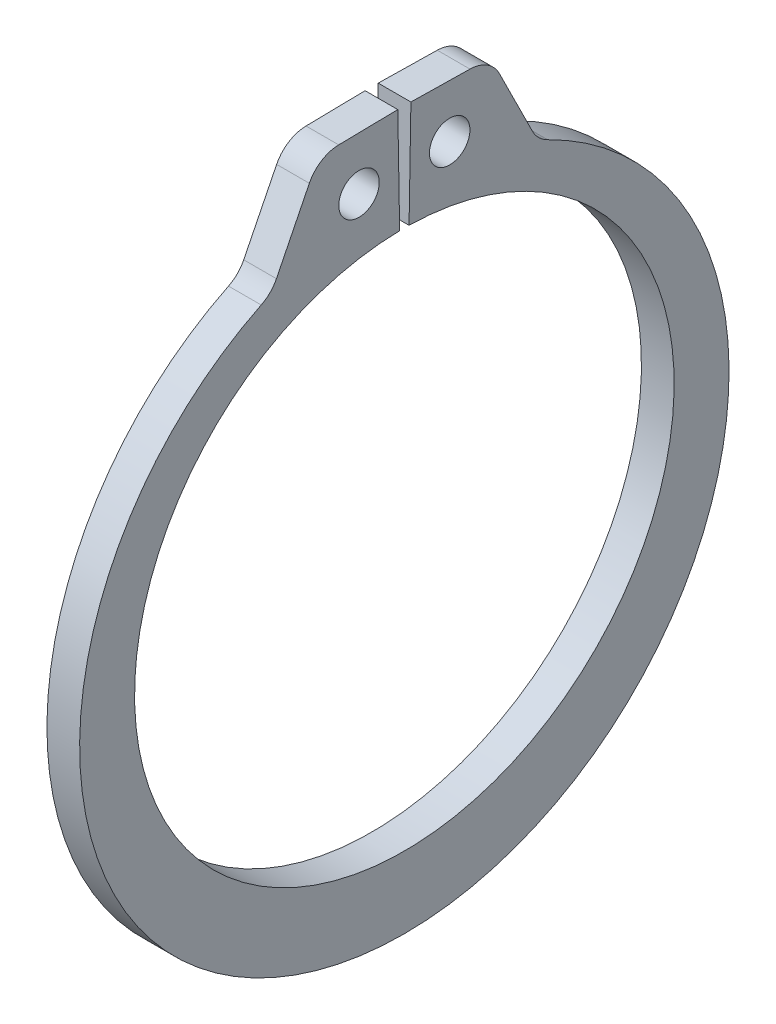
ISO-10303-21;
HEADER;
FILE_DESCRIPTION(('STEP AP214'),'2;1');
FILE_NAME('part.step','',(''),(''),'','','');
FILE_SCHEMA(('AUTOMOTIVE_DESIGN { 1 0 10303 214 1 1 1 1 }'));
ENDSEC;
DATA;
#1=APPLICATION_CONTEXT('core data for automotive mechanical design processes');
#2=APPLICATION_PROTOCOL_DEFINITION('international standard','automotive_design',2000,#1);
#3=PRODUCT_CONTEXT('',#1,'mechanical');
#4=PRODUCT('Part','Part','',(#3));
#5=PRODUCT_RELATED_PRODUCT_CATEGORY('part','',(#4));
#6=PRODUCT_DEFINITION_FORMATION('','',#4);
#7=PRODUCT_DEFINITION_CONTEXT('part definition',#1,'design');
#8=PRODUCT_DEFINITION('design','',#6,#7);
#9=PRODUCT_DEFINITION_SHAPE('','',#8);
#10=(LENGTH_UNIT() NAMED_UNIT(*) SI_UNIT(.MILLI.,.METRE.));
#11=(NAMED_UNIT(*) PLANE_ANGLE_UNIT() SI_UNIT($,.RADIAN.));
#12=(NAMED_UNIT(*) SI_UNIT($,.STERADIAN.) SOLID_ANGLE_UNIT());
#13=UNCERTAINTY_MEASURE_WITH_UNIT(LENGTH_MEASURE(1.E-05),#10,'distance_accuracy_value','');
#14=(GEOMETRIC_REPRESENTATION_CONTEXT(3) GLOBAL_UNCERTAINTY_ASSIGNED_CONTEXT((#13)) GLOBAL_UNIT_ASSIGNED_CONTEXT((#10,
#11,#12)) REPRESENTATION_CONTEXT('',''));
#15=CARTESIAN_POINT('',(0.,0.,0.));
#16=DIRECTION('',(0.,0.,1.));
#17=DIRECTION('',(1.,0.,0.));
#18=AXIS2_PLACEMENT_3D('',#15,#16,#17);
#19=CARTESIAN_POINT('',(-0.5334,0.,0.));
#20=DIRECTION('',(1.,0.,0.));
#21=DIRECTION('',(0.,0.,-1.));
#22=AXIS2_PLACEMENT_3D('',#19,#20,#21);
#23=PLANE('',#22);
#24=CARTESIAN_POINT('',(-0.5334,10.5040886416162,-1.47894687499924));
#25=DIRECTION('',(-1.,0.,0.));
#26=DIRECTION('',(0.,0.,1.));
#27=AXIS2_PLACEMENT_3D('',#24,#25,#26);
#28=CIRCLE('',#27,0.6604);
#29=CARTESIAN_POINT('',(-0.5334,10.5040886416162,-0.818546874999241));
#30=VERTEX_POINT('',#29);
#31=EDGE_CURVE('E134',#30,#30,#28,.F.);
#32=ORIENTED_EDGE('',*,*,#31,.T.);
#33=EDGE_LOOP('',(#32));
#34=FACE_BOUND('',#33,.T.);
#35=CARTESIAN_POINT('',(-0.5334,11.1279661301002,2.12169669403658));
#36=DIRECTION('',(-1.,0.,0.));
#37=DIRECTION('',(0.,0.,1.));
#38=AXIS2_PLACEMENT_3D('',#35,#36,#37);
#39=CIRCLE('',#38,1.0922);
#40=CARTESIAN_POINT('',(-0.5334,12.21999978275,2.14075821234738));
#41=VERTEX_POINT('',#40);
#42=CARTESIAN_POINT('',(-0.5334,11.6141614114107,3.09971253666458));
#43=VERTEX_POINT('',#42);
#44=EDGE_CURVE('E104',#41,#43,#39,.F.);
#45=ORIENTED_EDGE('',*,*,#44,.F.);
#46=DIRECTION('',(0.,0.0174524064372834,-0.999847695156391));
#47=VECTOR('',#46,1.);
#48=CARTESIAN_POINT('',(-0.5334,12.2536334279892,0.213887967092128));
#49=LINE('',#48,#47);
#50=CARTESIAN_POINT('',(-0.5334,12.2536334279892,0.213887967092128));
#51=VERTEX_POINT('',#50);
#52=EDGE_CURVE('E99',#41,#51,#49,.T.);
#53=ORIENTED_EDGE('',*,*,#52,.T.);
#54=DIRECTION('',(0.,-0.999847695156391,-0.0174524064372835));
#55=VECTOR('',#54,1.);
#56=CARTESIAN_POINT('',(-0.5334,8.79975954984091,0.153600374295176));
#57=LINE('',#56,#55);
#58=CARTESIAN_POINT('',(-0.5334,8.79975954984092,0.153600374295176));
#59=VERTEX_POINT('',#58);
#60=EDGE_CURVE('E131',#51,#59,#57,.T.);
#61=ORIENTED_EDGE('',*,*,#60,.T.);
#62=CARTESIAN_POINT('',(-0.5334,0.,0.));
#63=DIRECTION('',(-1.,0.,0.));
#64=DIRECTION('',(0.,0.,1.));
#65=AXIS2_PLACEMENT_3D('',#62,#63,#64);
#66=CIRCLE('',#65,8.8011);
#67=CARTESIAN_POINT('',(-0.5334,8.79975954984092,-0.153600374295176));
#68=VERTEX_POINT('',#67);
#69=EDGE_CURVE('E181',#59,#68,#66,.F.);
#70=ORIENTED_EDGE('',*,*,#69,.T.);
#71=DIRECTION('',(0.,0.999847695156391,-0.0174524064372835));
#72=VECTOR('',#71,1.);
#73=CARTESIAN_POINT('',(-0.5334,8.79975954984091,-0.153600374295176));
#74=LINE('',#73,#72);
#75=CARTESIAN_POINT('',(-0.5334,12.2536334279892,-0.213887967092128));
#76=VERTEX_POINT('',#75);
#77=EDGE_CURVE('E141',#68,#76,#74,.T.);
#78=ORIENTED_EDGE('',*,*,#77,.T.);
#79=DIRECTION('',(0.,-0.0174524064372834,-0.999847695156391));
#80=VECTOR('',#79,1.);
#81=CARTESIAN_POINT('',(-0.5334,12.2536334279892,-0.213887967092128));
#82=LINE('',#81,#80);
#83=CARTESIAN_POINT('',(-0.5334,12.21999978275,-2.14075821234738));
#84=VERTEX_POINT('',#83);
#85=EDGE_CURVE('E148',#76,#84,#82,.T.);
#86=ORIENTED_EDGE('',*,*,#85,.T.);
#87=CARTESIAN_POINT('',(-0.5334,11.1279661301002,-2.12169669403658));
#88=DIRECTION('',(-1.,0.,0.));
#89=DIRECTION('',(0.,0.,1.));
#90=AXIS2_PLACEMENT_3D('',#87,#88,#89);
#91=CIRCLE('',#90,1.0922);
#92=CARTESIAN_POINT('',(-0.5334,11.6141614114107,-3.09971253666458));
#93=VERTEX_POINT('',#92);
#94=EDGE_CURVE('E151',#93,#84,#91,.F.);
#95=ORIENTED_EDGE('',*,*,#94,.F.);
#96=DIRECTION('',(0.,-0.895454900776411,-0.445152244378829));
#97=VECTOR('',#96,1.);
#98=CARTESIAN_POINT('',(-0.5334,12.2084177333914,-2.80429337570331));
#99=LINE('',#98,#97);
#100=CARTESIAN_POINT('',(-0.5334,9.45539137797145,-4.17288922557434));
#101=VERTEX_POINT('',#100);
#102=EDGE_CURVE('E154',#93,#101,#99,.T.);
#103=ORIENTED_EDGE('',*,*,#102,.T.);
#104=CARTESIAN_POINT('',(-0.5334,9.941586659282,-5.15090506820234));
#105=DIRECTION('',(-1.,0.,0.));
#106=DIRECTION('',(0.,0.,1.));
#107=AXIS2_PLACEMENT_3D('',#104,#105,#106);
#108=CIRCLE('',#107,1.0922);
#109=CARTESIAN_POINT('',(-0.5334,8.96124610534802,-4.66941442622431));
#110=VERTEX_POINT('',#109);
#111=EDGE_CURVE('E187',#101,#110,#108,.F.);
#112=ORIENTED_EDGE('',*,*,#111,.T.);
#113=CARTESIAN_POINT('',(-0.5334,-0.545929997486656,0.));
#114=DIRECTION('',(-1.,0.,0.));
#115=DIRECTION('',(0.,0.,1.));
#116=AXIS2_PLACEMENT_3D('',#113,#114,#115);
#117=CIRCLE('',#116,10.5919700025133);
#118=CARTESIAN_POINT('',(-0.5334,8.96124610534802,4.66941442622431));
#119=VERTEX_POINT('',#118);
#120=EDGE_CURVE('E189',#119,#110,#117,.F.);
#121=ORIENTED_EDGE('',*,*,#120,.F.);
#122=CARTESIAN_POINT('',(-0.5334,9.941586659282,5.15090506820234));
#123=DIRECTION('',(-1.,0.,0.));
#124=DIRECTION('',(0.,0.,1.));
#125=AXIS2_PLACEMENT_3D('',#122,#123,#124);
#126=CIRCLE('',#125,1.0922);
#127=CARTESIAN_POINT('',(-0.5334,9.45539137797145,4.17288922557434));
#128=VERTEX_POINT('',#127);
#129=EDGE_CURVE('E117',#119,#128,#126,.F.);
#130=ORIENTED_EDGE('',*,*,#129,.T.);
#131=DIRECTION('',(0.,0.895454900776411,-0.445152244378829));
#132=VECTOR('',#131,1.);
#133=CARTESIAN_POINT('',(-0.5334,12.2084177333914,2.80429337570331));
#134=LINE('',#133,#132);
#135=EDGE_CURVE('E114',#128,#43,#134,.T.);
#136=ORIENTED_EDGE('',*,*,#135,.T.);
#137=EDGE_LOOP('',(#45,#53,#61,#70,#78,#86,#95,#103,#112,#121,#130,#136));
#138=FACE_BOUND('',#137,.T.);
#139=CARTESIAN_POINT('',(-0.5334,10.5040886416162,1.47894687499924));
#140=DIRECTION('',(-1.,0.,0.));
#141=DIRECTION('',(0.,0.,1.));
#142=AXIS2_PLACEMENT_3D('',#139,#140,#141);
#143=CIRCLE('',#142,0.6604);
#144=CARTESIAN_POINT('',(-0.5334,10.5040886416162,2.13934687499924));
#145=VERTEX_POINT('',#144);
#146=EDGE_CURVE('E21',#145,#145,#143,.F.);
#147=ORIENTED_EDGE('',*,*,#146,.T.);
#148=EDGE_LOOP('',(#147));
#149=FACE_BOUND('',#148,.T.);
#150=ADVANCED_FACE('F18',(#34,#138,#149),#23,.F.);
#151=CARTESIAN_POINT('',(0.5334,10.5040886416162,1.47894687499924));
#152=DIRECTION('',(-1.,0.,0.));
#153=DIRECTION('',(0.,0.,1.));
#154=AXIS2_PLACEMENT_3D('',#151,#152,#153);
#155=CYLINDRICAL_SURFACE('',#154,0.6604);
#156=CARTESIAN_POINT('',(0.5334,10.5040886416162,1.47894687499924));
#157=DIRECTION('',(-1.,0.,0.));
#158=DIRECTION('',(0.,0.,1.));
#159=AXIS2_PLACEMENT_3D('',#156,#157,#158);
#160=CIRCLE('',#159,0.6604);
#161=CARTESIAN_POINT('',(0.5334,10.5040886416162,2.13934687499924));
#162=VERTEX_POINT('',#161);
#163=EDGE_CURVE('E176',#162,#162,#160,.T.);
#164=ORIENTED_EDGE('',*,*,#163,.F.);
#165=EDGE_LOOP('',(#164));
#166=FACE_BOUND('',#165,.T.);
#167=ORIENTED_EDGE('',*,*,#146,.F.);
#168=EDGE_LOOP('',(#167));
#169=FACE_BOUND('',#168,.T.);
#170=ADVANCED_FACE('F361',(#166,#169),#155,.F.);
#171=CARTESIAN_POINT('',(0.5334,12.2536334279892,0.213887967092128));
#172=DIRECTION('',(0.,-0.999847695156391,-0.0174524064372834));
#173=DIRECTION('',(0.,0.0174524064372834,-0.999847695156391));
#174=AXIS2_PLACEMENT_3D('',#171,#172,#173);
#175=PLANE('',#174);
#176=DIRECTION('',(-1.,0.,0.));
#177=VECTOR('',#176,1.);
#178=CARTESIAN_POINT('',(0.5334,12.21999978275,2.14075821234738));
#179=LINE('',#178,#177);
#180=CARTESIAN_POINT('',(0.5334,12.21999978275,2.14075821234738));
#181=VERTEX_POINT('',#180);
#182=EDGE_CURVE('E111',#181,#41,#179,.T.);
#183=ORIENTED_EDGE('',*,*,#182,.F.);
#184=DIRECTION('',(0.,-0.0174524064372837,0.999847695156391));
#185=VECTOR('',#184,1.);
#186=CARTESIAN_POINT('',(0.5334,12.2536334279892,0.213887967092128));
#187=LINE('',#186,#185);
#188=CARTESIAN_POINT('',(0.5334,12.2536334279892,0.213887967092128));
#189=VERTEX_POINT('',#188);
#190=EDGE_CURVE('E175',#189,#181,#187,.T.);
#191=ORIENTED_EDGE('',*,*,#190,.F.);
#192=DIRECTION('',(1.,0.,0.));
#193=VECTOR('',#192,1.);
#194=CARTESIAN_POINT('',(0.5334,12.2536334279892,0.213887967092128));
#195=LINE('',#194,#193);
#196=EDGE_CURVE('E135',#189,#51,#195,.F.);
#197=ORIENTED_EDGE('',*,*,#196,.T.);
#198=ORIENTED_EDGE('',*,*,#52,.F.);
#199=EDGE_LOOP('',(#183,#191,#197,#198));
#200=FACE_BOUND('',#199,.T.);
#201=ADVANCED_FACE('F239',(#200),#175,.F.);
#202=CARTESIAN_POINT('',(0.5334,11.1279661301002,2.12169669403658));
#203=DIRECTION('',(-1.,0.,0.));
#204=DIRECTION('',(0.,0.,1.));
#205=AXIS2_PLACEMENT_3D('',#202,#203,#204);
#206=CYLINDRICAL_SURFACE('',#205,1.0922);
#207=ORIENTED_EDGE('',*,*,#44,.T.);
#208=DIRECTION('',(1.,0.,0.));
#209=VECTOR('',#208,1.);
#210=CARTESIAN_POINT('',(0.5334,11.6141614114107,3.09971253666458));
#211=LINE('',#210,#209);
#212=CARTESIAN_POINT('',(0.5334,11.6141614114107,3.09971253666458));
#213=VERTEX_POINT('',#212);
#214=EDGE_CURVE('E109',#43,#213,#211,.T.);
#215=ORIENTED_EDGE('',*,*,#214,.T.);
#216=CARTESIAN_POINT('',(0.5334,11.1279661301002,2.12169669403658));
#217=DIRECTION('',(-1.,0.,0.));
#218=DIRECTION('',(0.,0.,1.));
#219=AXIS2_PLACEMENT_3D('',#216,#217,#218);
#220=CIRCLE('',#219,1.0922);
#221=EDGE_CURVE('E173',#181,#213,#220,.F.);
#222=ORIENTED_EDGE('',*,*,#221,.F.);
#223=ORIENTED_EDGE('',*,*,#182,.T.);
#224=EDGE_LOOP('',(#207,#215,#222,#223));
#225=FACE_BOUND('',#224,.T.);
#226=ADVANCED_FACE('F106',(#225),#206,.T.);
#227=CARTESIAN_POINT('',(0.5334,12.2084177333914,2.80429337570331));
#228=DIRECTION('',(0.,-0.445152244378829,-0.895454900776411));
#229=DIRECTION('',(0.,0.895454900776411,-0.445152244378829));
#230=AXIS2_PLACEMENT_3D('',#227,#228,#229);
#231=PLANE('',#230);
#232=DIRECTION('',(-1.,0.,0.));
#233=VECTOR('',#232,1.);
#234=CARTESIAN_POINT('',(0.5334,9.45539137797145,4.17288922557434));
#235=LINE('',#234,#233);
#236=CARTESIAN_POINT('',(0.5334,9.45539137797145,4.17288922557434));
#237=VERTEX_POINT('',#236);
#238=EDGE_CURVE('E128',#128,#237,#235,.F.);
#239=ORIENTED_EDGE('',*,*,#238,.T.);
#240=DIRECTION('',(0.,-0.895454900776411,0.445152244378828));
#241=VECTOR('',#240,1.);
#242=CARTESIAN_POINT('',(0.5334,11.6141614114107,3.09971253666458));
#243=LINE('',#242,#241);
#244=EDGE_CURVE('E123',#213,#237,#243,.T.);
#245=ORIENTED_EDGE('',*,*,#244,.F.);
#246=ORIENTED_EDGE('',*,*,#214,.F.);
#247=ORIENTED_EDGE('',*,*,#135,.F.);
#248=EDGE_LOOP('',(#239,#245,#246,#247));
#249=FACE_BOUND('',#248,.T.);
#250=ADVANCED_FACE('F121',(#249),#231,.F.);
#251=CARTESIAN_POINT('',(0.5334,9.941586659282,5.15090506820234));
#252=DIRECTION('',(-1.,0.,0.));
#253=DIRECTION('',(0.,0.,1.));
#254=AXIS2_PLACEMENT_3D('',#251,#252,#253);
#255=CYLINDRICAL_SURFACE('',#254,1.0922);
#256=ORIENTED_EDGE('',*,*,#238,.F.);
#257=ORIENTED_EDGE('',*,*,#129,.F.);
#258=DIRECTION('',(-1.,0.,0.));
#259=VECTOR('',#258,1.);
#260=CARTESIAN_POINT('',(0.5334,8.96124610534802,4.66941442622431));
#261=LINE('',#260,#259);
#262=CARTESIAN_POINT('',(0.5334,8.96124610534802,4.66941442622431));
#263=VERTEX_POINT('',#262);
#264=EDGE_CURVE('E192',#263,#119,#261,.T.);
#265=ORIENTED_EDGE('',*,*,#264,.F.);
#266=CARTESIAN_POINT('',(0.5334,9.941586659282,5.15090506820234));
#267=DIRECTION('',(-1.,0.,0.));
#268=DIRECTION('',(0.,0.,1.));
#269=AXIS2_PLACEMENT_3D('',#266,#267,#268);
#270=CIRCLE('',#269,1.0922);
#271=EDGE_CURVE('E170',#237,#263,#270,.T.);
#272=ORIENTED_EDGE('',*,*,#271,.F.);
#273=EDGE_LOOP('',(#256,#257,#265,#272));
#274=FACE_BOUND('',#273,.T.);
#275=ADVANCED_FACE('F269',(#274),#255,.F.);
#276=CARTESIAN_POINT('',(0.5334,-0.545929997486656,0.));
#277=DIRECTION('',(-1.,0.,0.));
#278=DIRECTION('',(0.,0.,1.));
#279=AXIS2_PLACEMENT_3D('',#276,#277,#278);
#280=CYLINDRICAL_SURFACE('',#279,10.5919700025133);
#281=ORIENTED_EDGE('',*,*,#120,.T.);
#282=DIRECTION('',(-1.,0.,0.));
#283=VECTOR('',#282,1.);
#284=CARTESIAN_POINT('',(0.5334,8.96124610534802,-4.66941442622431));
#285=LINE('',#284,#283);
#286=CARTESIAN_POINT('',(0.5334,8.96124610534802,-4.66941442622431));
#287=VERTEX_POINT('',#286);
#288=EDGE_CURVE('E156',#110,#287,#285,.F.);
#289=ORIENTED_EDGE('',*,*,#288,.T.);
#290=CARTESIAN_POINT('',(0.5334,-0.545929997486656,0.));
#291=DIRECTION('',(-1.,0.,0.));
#292=DIRECTION('',(0.,0.,1.));
#293=AXIS2_PLACEMENT_3D('',#290,#291,#292);
#294=CIRCLE('',#293,10.5919700025133);
#295=EDGE_CURVE('E168',#263,#287,#294,.F.);
#296=ORIENTED_EDGE('',*,*,#295,.F.);
#297=ORIENTED_EDGE('',*,*,#264,.T.);
#298=EDGE_LOOP('',(#281,#289,#296,#297));
#299=FACE_BOUND('',#298,.T.);
#300=ADVANCED_FACE('F267',(#299),#280,.T.);
#301=CARTESIAN_POINT('',(0.5334,9.941586659282,-5.15090506820234));
#302=DIRECTION('',(-1.,0.,0.));
#303=DIRECTION('',(0.,0.,1.));
#304=AXIS2_PLACEMENT_3D('',#301,#302,#303);
#305=CYLINDRICAL_SURFACE('',#304,1.0922);
#306=ORIENTED_EDGE('',*,*,#288,.F.);
#307=ORIENTED_EDGE('',*,*,#111,.F.);
#308=DIRECTION('',(1.,0.,0.));
#309=VECTOR('',#308,1.);
#310=CARTESIAN_POINT('',(0.5334,9.45539137797145,-4.17288922557434));
#311=LINE('',#310,#309);
#312=CARTESIAN_POINT('',(0.5334,9.45539137797145,-4.17288922557434));
#313=VERTEX_POINT('',#312);
#314=EDGE_CURVE('E155',#101,#313,#311,.T.);
#315=ORIENTED_EDGE('',*,*,#314,.T.);
#316=CARTESIAN_POINT('',(0.5334,9.941586659282,-5.15090506820234));
#317=DIRECTION('',(-1.,0.,0.));
#318=DIRECTION('',(0.,0.,1.));
#319=AXIS2_PLACEMENT_3D('',#316,#317,#318);
#320=CIRCLE('',#319,1.0922);
#321=EDGE_CURVE('E165',#287,#313,#320,.T.);
#322=ORIENTED_EDGE('',*,*,#321,.F.);
#323=EDGE_LOOP('',(#306,#307,#315,#322));
#324=FACE_BOUND('',#323,.T.);
#325=ADVANCED_FACE('F265',(#324),#305,.F.);
#326=CARTESIAN_POINT('',(0.5334,12.2084177333914,-2.80429337570331));
#327=DIRECTION('',(0.,-0.445152244378829,0.895454900776411));
#328=DIRECTION('',(0.,-0.895454900776411,-0.445152244378829));
#329=AXIS2_PLACEMENT_3D('',#326,#327,#328);
#330=PLANE('',#329);
#331=ORIENTED_EDGE('',*,*,#314,.F.);
#332=ORIENTED_EDGE('',*,*,#102,.F.);
#333=DIRECTION('',(-1.,0.,0.));
#334=VECTOR('',#333,1.);
#335=CARTESIAN_POINT('',(0.5334,11.6141614114107,-3.09971253666458));
#336=LINE('',#335,#334);
#337=CARTESIAN_POINT('',(0.5334,11.6141614114107,-3.09971253666458));
#338=VERTEX_POINT('',#337);
#339=EDGE_CURVE('E186',#338,#93,#336,.T.);
#340=ORIENTED_EDGE('',*,*,#339,.F.);
#341=DIRECTION('',(0.,0.895454900776411,0.445152244378828));
#342=VECTOR('',#341,1.);
#343=CARTESIAN_POINT('',(0.5334,9.45539137797145,-4.17288922557434));
#344=LINE('',#343,#342);
#345=EDGE_CURVE('E164',#313,#338,#344,.T.);
#346=ORIENTED_EDGE('',*,*,#345,.F.);
#347=EDGE_LOOP('',(#331,#332,#340,#346));
#348=FACE_BOUND('',#347,.T.);
#349=ADVANCED_FACE('F261',(#348),#330,.F.);
#350=CARTESIAN_POINT('',(0.5334,11.1279661301002,-2.12169669403658));
#351=DIRECTION('',(-1.,0.,0.));
#352=DIRECTION('',(0.,0.,1.));
#353=AXIS2_PLACEMENT_3D('',#350,#351,#352);
#354=CYLINDRICAL_SURFACE('',#353,1.0922);
#355=ORIENTED_EDGE('',*,*,#94,.T.);
#356=DIRECTION('',(1.,0.,0.));
#357=VECTOR('',#356,1.);
#358=CARTESIAN_POINT('',(0.5334,12.21999978275,-2.14075821234738));
#359=LINE('',#358,#357);
#360=CARTESIAN_POINT('',(0.5334,12.21999978275,-2.14075821234738));
#361=VERTEX_POINT('',#360);
#362=EDGE_CURVE('E150',#84,#361,#359,.T.);
#363=ORIENTED_EDGE('',*,*,#362,.T.);
#364=CARTESIAN_POINT('',(0.5334,11.1279661301002,-2.12169669403658));
#365=DIRECTION('',(-1.,0.,0.));
#366=DIRECTION('',(0.,0.,1.));
#367=AXIS2_PLACEMENT_3D('',#364,#365,#366);
#368=CIRCLE('',#367,1.0922);
#369=EDGE_CURVE('E160',#338,#361,#368,.F.);
#370=ORIENTED_EDGE('',*,*,#369,.F.);
#371=ORIENTED_EDGE('',*,*,#339,.T.);
#372=EDGE_LOOP('',(#355,#363,#370,#371));
#373=FACE_BOUND('',#372,.T.);
#374=ADVANCED_FACE('F256',(#373),#354,.T.);
#375=CARTESIAN_POINT('',(0.5334,12.2536334279892,-0.213887967092128));
#376=DIRECTION('',(0.,-0.999847695156391,0.0174524064372834));
#377=DIRECTION('',(0.,-0.0174524064372834,-0.999847695156391));
#378=AXIS2_PLACEMENT_3D('',#375,#376,#377);
#379=PLANE('',#378);
#380=ORIENTED_EDGE('',*,*,#362,.F.);
#381=ORIENTED_EDGE('',*,*,#85,.F.);
#382=DIRECTION('',(1.,0.,0.));
#383=VECTOR('',#382,1.);
#384=CARTESIAN_POINT('',(0.5334,12.2536334279892,-0.213887967092128));
#385=LINE('',#384,#383);
#386=CARTESIAN_POINT('',(0.5334,12.2536334279892,-0.213887967092128));
#387=VERTEX_POINT('',#386);
#388=EDGE_CURVE('E145',#76,#387,#385,.T.);
#389=ORIENTED_EDGE('',*,*,#388,.T.);
#390=DIRECTION('',(0.,0.0174524064372837,0.999847695156391));
#391=VECTOR('',#390,1.);
#392=CARTESIAN_POINT('',(0.5334,12.21999978275,-2.14075821234738));
#393=LINE('',#392,#391);
#394=EDGE_CURVE('E163',#361,#387,#393,.T.);
#395=ORIENTED_EDGE('',*,*,#394,.F.);
#396=EDGE_LOOP('',(#380,#381,#389,#395));
#397=FACE_BOUND('',#396,.T.);
#398=ADVANCED_FACE('F253',(#397),#379,.F.);
#399=CARTESIAN_POINT('',(0.5334,8.79975954984091,-0.153600374295176));
#400=DIRECTION('',(0.,-0.0174524064372835,-0.999847695156391));
#401=DIRECTION('',(0.,0.999847695156391,-0.0174524064372835));
#402=AXIS2_PLACEMENT_3D('',#399,#400,#401);
#403=PLANE('',#402);
#404=DIRECTION('',(-1.,0.,0.));
#405=VECTOR('',#404,1.);
#406=CARTESIAN_POINT('',(0.5334,8.79975954984092,-0.153600374295176));
#407=LINE('',#406,#405);
#408=CARTESIAN_POINT('',(0.5334,8.79975954984092,-0.153600374295176));
#409=VERTEX_POINT('',#408);
#410=EDGE_CURVE('E144',#68,#409,#407,.F.);
#411=ORIENTED_EDGE('',*,*,#410,.T.);
#412=DIRECTION('',(0.,-0.999847695156391,0.0174524064372835));
#413=VECTOR('',#412,1.);
#414=CARTESIAN_POINT('',(0.5334,12.2536334279892,-0.213887967092128));
#415=LINE('',#414,#413);
#416=EDGE_CURVE('E159',#387,#409,#415,.T.);
#417=ORIENTED_EDGE('',*,*,#416,.F.);
#418=ORIENTED_EDGE('',*,*,#388,.F.);
#419=ORIENTED_EDGE('',*,*,#77,.F.);
#420=EDGE_LOOP('',(#411,#417,#418,#419));
#421=FACE_BOUND('',#420,.T.);
#422=ADVANCED_FACE('F245',(#421),#403,.F.);
#423=CARTESIAN_POINT('',(0.5334,0.,0.));
#424=DIRECTION('',(-1.,0.,0.));
#425=DIRECTION('',(0.,0.,1.));
#426=AXIS2_PLACEMENT_3D('',#423,#424,#425);
#427=CYLINDRICAL_SURFACE('',#426,8.8011);
#428=DIRECTION('',(1.,0.,0.));
#429=VECTOR('',#428,1.);
#430=CARTESIAN_POINT('',(0.5334,8.79975954984091,0.153600374295176));
#431=LINE('',#430,#429);
#432=CARTESIAN_POINT('',(0.5334,8.79975954984092,0.153600374295176));
#433=VERTEX_POINT('',#432);
#434=EDGE_CURVE('E183',#59,#433,#431,.T.);
#435=ORIENTED_EDGE('',*,*,#434,.T.);
#436=CARTESIAN_POINT('',(0.5334,0.,0.));
#437=DIRECTION('',(-1.,0.,0.));
#438=DIRECTION('',(0.,0.,1.));
#439=AXIS2_PLACEMENT_3D('',#436,#437,#438);
#440=CIRCLE('',#439,8.8011);
#441=EDGE_CURVE('E36',#409,#433,#440,.T.);
#442=ORIENTED_EDGE('',*,*,#441,.F.);
#443=ORIENTED_EDGE('',*,*,#410,.F.);
#444=ORIENTED_EDGE('',*,*,#69,.F.);
#445=EDGE_LOOP('',(#435,#442,#443,#444));
#446=FACE_BOUND('',#445,.T.);
#447=ADVANCED_FACE('F247',(#446),#427,.F.);
#448=CARTESIAN_POINT('',(0.5334,8.79975954984091,0.153600374295176));
#449=DIRECTION('',(0.,-0.0174524064372835,0.999847695156391));
#450=DIRECTION('',(0.,-0.999847695156391,-0.0174524064372835));
#451=AXIS2_PLACEMENT_3D('',#448,#449,#450);
#452=PLANE('',#451);
#453=ORIENTED_EDGE('',*,*,#196,.F.);
#454=DIRECTION('',(0.,0.999847695156391,0.0174524064372835));
#455=VECTOR('',#454,1.);
#456=CARTESIAN_POINT('',(0.5334,8.79975954984091,0.153600374295176));
#457=LINE('',#456,#455);
#458=EDGE_CURVE('E27',#433,#189,#457,.T.);
#459=ORIENTED_EDGE('',*,*,#458,.F.);
#460=ORIENTED_EDGE('',*,*,#434,.F.);
#461=ORIENTED_EDGE('',*,*,#60,.F.);
#462=EDGE_LOOP('',(#453,#459,#460,#461));
#463=FACE_BOUND('',#462,.T.);
#464=ADVANCED_FACE('F237',(#463),#452,.F.);
#465=CARTESIAN_POINT('',(0.5334,10.5040886416162,-1.47894687499924));
#466=DIRECTION('',(-1.,0.,0.));
#467=DIRECTION('',(0.,0.,1.));
#468=AXIS2_PLACEMENT_3D('',#465,#466,#467);
#469=CYLINDRICAL_SURFACE('',#468,0.6604);
#470=CARTESIAN_POINT('',(0.5334,10.5040886416162,-1.47894687499924));
#471=DIRECTION('',(-1.,0.,0.));
#472=DIRECTION('',(0.,0.,1.));
#473=AXIS2_PLACEMENT_3D('',#470,#471,#472);
#474=CIRCLE('',#473,0.6604);
#475=CARTESIAN_POINT('',(0.5334,10.5040886416162,-0.818546874999241));
#476=VERTEX_POINT('',#475);
#477=EDGE_CURVE('E11',#476,#476,#474,.T.);
#478=ORIENTED_EDGE('',*,*,#477,.F.);
#479=EDGE_LOOP('',(#478));
#480=FACE_BOUND('',#479,.T.);
#481=ORIENTED_EDGE('',*,*,#31,.F.);
#482=EDGE_LOOP('',(#481));
#483=FACE_BOUND('',#482,.T.);
#484=ADVANCED_FACE('F280',(#480,#483),#469,.F.);
#485=CARTESIAN_POINT('',(0.5334,0.,0.));
#486=DIRECTION('',(1.,0.,0.));
#487=DIRECTION('',(0.,0.,-1.));
#488=AXIS2_PLACEMENT_3D('',#485,#486,#487);
#489=PLANE('',#488);
#490=ORIENTED_EDGE('',*,*,#477,.T.);
#491=EDGE_LOOP('',(#490));
#492=FACE_BOUND('',#491,.T.);
#493=ORIENTED_EDGE('',*,*,#441,.T.);
#494=ORIENTED_EDGE('',*,*,#458,.T.);
#495=ORIENTED_EDGE('',*,*,#190,.T.);
#496=ORIENTED_EDGE('',*,*,#221,.T.);
#497=ORIENTED_EDGE('',*,*,#244,.T.);
#498=ORIENTED_EDGE('',*,*,#271,.T.);
#499=ORIENTED_EDGE('',*,*,#295,.T.);
#500=ORIENTED_EDGE('',*,*,#321,.T.);
#501=ORIENTED_EDGE('',*,*,#345,.T.);
#502=ORIENTED_EDGE('',*,*,#369,.T.);
#503=ORIENTED_EDGE('',*,*,#394,.T.);
#504=ORIENTED_EDGE('',*,*,#416,.T.);
#505=EDGE_LOOP('',(#493,#494,#495,#496,#497,#498,#499,#500,#501,#502,#503,#504));
#506=FACE_BOUND('',#505,.T.);
#507=ORIENTED_EDGE('',*,*,#163,.T.);
#508=EDGE_LOOP('',(#507));
#509=FACE_BOUND('',#508,.T.);
#510=ADVANCED_FACE('F230',(#492,#506,#509),#489,.T.);
#511=CLOSED_SHELL('',(#150,#170,#201,#226,#250,#275,#300,#325,#349,#374,#398,#422,#447,#464,
#484,#510));
#512=MANIFOLD_SOLID_BREP('B1',#511);
#513=ADVANCED_BREP_SHAPE_REPRESENTATION('',(#18,#512),#14);
#514=SHAPE_DEFINITION_REPRESENTATION(#9,#513);
ENDSEC;
END-ISO-10303-21;
